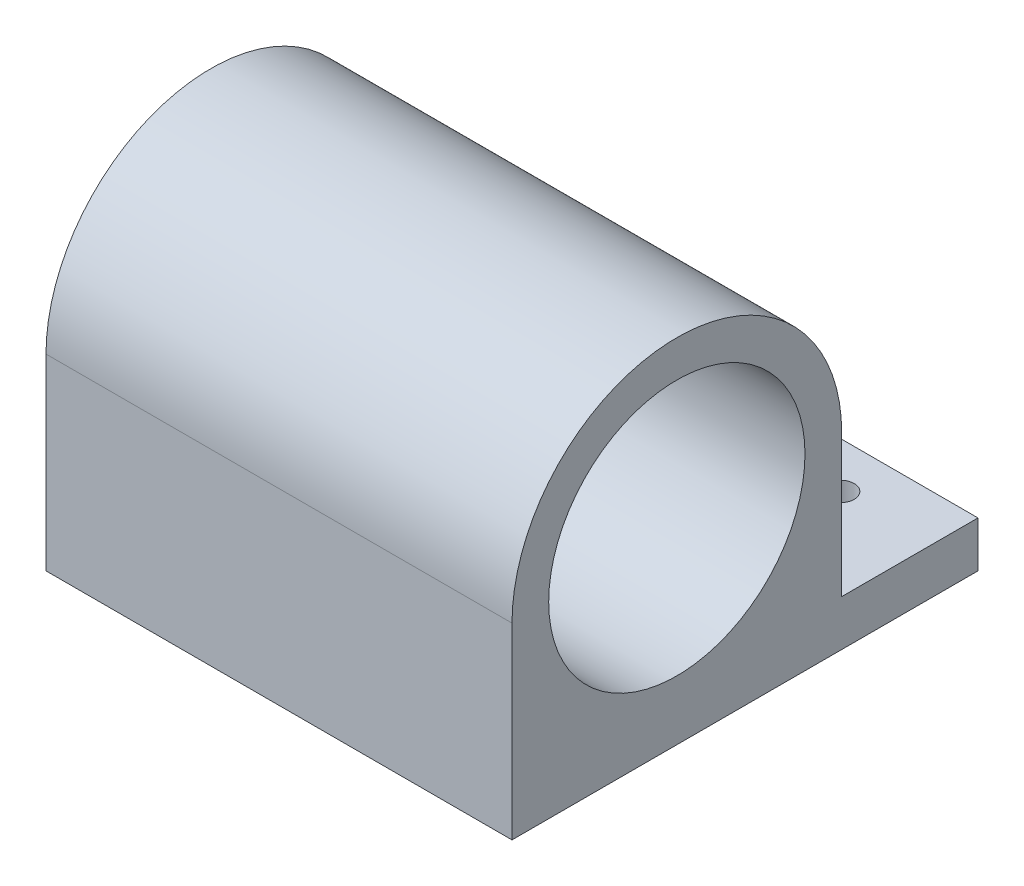
ISO-10303-21;
HEADER;
FILE_DESCRIPTION(('STEP AP214'),'2;1');
FILE_NAME('part.step','',(''),(''),'','','');
FILE_SCHEMA(('AUTOMOTIVE_DESIGN { 1 0 10303 214 1 1 1 1 }'));
ENDSEC;
DATA;
#1=APPLICATION_CONTEXT('core data for automotive mechanical design processes');
#2=APPLICATION_PROTOCOL_DEFINITION('international standard','automotive_design',2000,#1);
#3=PRODUCT_CONTEXT('',#1,'mechanical');
#4=PRODUCT('Part','Part','',(#3));
#5=PRODUCT_RELATED_PRODUCT_CATEGORY('part','',(#4));
#6=PRODUCT_DEFINITION_FORMATION('','',#4);
#7=PRODUCT_DEFINITION_CONTEXT('part definition',#1,'design');
#8=PRODUCT_DEFINITION('design','',#6,#7);
#9=PRODUCT_DEFINITION_SHAPE('','',#8);
#10=(LENGTH_UNIT() NAMED_UNIT(*) SI_UNIT(.MILLI.,.METRE.));
#11=(NAMED_UNIT(*) PLANE_ANGLE_UNIT() SI_UNIT($,.RADIAN.));
#12=(NAMED_UNIT(*) SI_UNIT($,.STERADIAN.) SOLID_ANGLE_UNIT());
#13=UNCERTAINTY_MEASURE_WITH_UNIT(LENGTH_MEASURE(1.E-05),#10,'distance_accuracy_value','');
#14=(GEOMETRIC_REPRESENTATION_CONTEXT(3) GLOBAL_UNCERTAINTY_ASSIGNED_CONTEXT((#13)) GLOBAL_UNIT_ASSIGNED_CONTEXT((#10,
#11,#12)) REPRESENTATION_CONTEXT('',''));
#15=CARTESIAN_POINT('',(0.,0.,0.));
#16=DIRECTION('',(0.,0.,1.));
#17=DIRECTION('',(1.,0.,0.));
#18=AXIS2_PLACEMENT_3D('',#15,#16,#17);
#19=CARTESIAN_POINT('',(0.,5.,0.));
#20=DIRECTION('',(0.,-1.,0.));
#21=DIRECTION('',(0.,0.,-1.));
#22=AXIS2_PLACEMENT_3D('',#19,#20,#21);
#23=PLANE('',#22);
#24=CARTESIAN_POINT('',(40.8,5.,-45.8));
#25=DIRECTION('',(0.,1.,0.));
#26=DIRECTION('',(0.,0.,1.));
#27=AXIS2_PLACEMENT_3D('',#24,#25,#26);
#28=CIRCLE('',#27,1.5);
#29=CARTESIAN_POINT('',(40.8,5.,-44.3));
#30=VERTEX_POINT('',#29);
#31=EDGE_CURVE('E159',#30,#30,#28,.T.);
#32=ORIENTED_EDGE('',*,*,#31,.F.);
#33=EDGE_LOOP('',(#32));
#34=FACE_BOUND('',#33,.T.);
#35=CARTESIAN_POINT('',(10.,5.,-45.8));
#36=DIRECTION('',(0.,1.,0.));
#37=DIRECTION('',(0.,0.,1.));
#38=AXIS2_PLACEMENT_3D('',#35,#36,#37);
#39=CIRCLE('',#38,1.5);
#40=CARTESIAN_POINT('',(10.,5.,-44.3));
#41=VERTEX_POINT('',#40);
#42=EDGE_CURVE('E98',#41,#41,#39,.T.);
#43=ORIENTED_EDGE('',*,*,#42,.F.);
#44=EDGE_LOOP('',(#43));
#45=FACE_BOUND('',#44,.T.);
#46=DIRECTION('',(-1.,0.,0.));
#47=VECTOR('',#46,1.);
#48=CARTESIAN_POINT('',(99.8909075084175,5.,-35.94));
#49=LINE('',#48,#47);
#50=CARTESIAN_POINT('',(50.8,5.,-35.94));
#51=VERTEX_POINT('',#50);
#52=CARTESIAN_POINT('',(0.,5.,-35.94));
#53=VERTEX_POINT('',#52);
#54=EDGE_CURVE('E50',#51,#53,#49,.T.);
#55=ORIENTED_EDGE('',*,*,#54,.F.);
#56=DIRECTION('',(0.,0.,-1.));
#57=VECTOR('',#56,1.);
#58=CARTESIAN_POINT('',(50.8,5.,0.));
#59=LINE('',#58,#57);
#60=CARTESIAN_POINT('',(50.8,5.,-50.8));
#61=VERTEX_POINT('',#60);
#62=EDGE_CURVE('E166',#51,#61,#59,.T.);
#63=ORIENTED_EDGE('',*,*,#62,.T.);
#64=DIRECTION('',(-1.,0.,0.));
#65=VECTOR('',#64,1.);
#66=CARTESIAN_POINT('',(0.,5.,-50.8));
#67=LINE('',#66,#65);
#68=CARTESIAN_POINT('',(0.,5.,-50.8));
#69=VERTEX_POINT('',#68);
#70=EDGE_CURVE('E56',#61,#69,#67,.T.);
#71=ORIENTED_EDGE('',*,*,#70,.T.);
#72=DIRECTION('',(0.,0.,1.));
#73=VECTOR('',#72,1.);
#74=CARTESIAN_POINT('',(0.,5.,0.));
#75=LINE('',#74,#73);
#76=EDGE_CURVE('E85',#69,#53,#75,.T.);
#77=ORIENTED_EDGE('',*,*,#76,.T.);
#78=EDGE_LOOP('',(#55,#63,#71,#77));
#79=FACE_BOUND('',#78,.T.);
#80=ADVANCED_FACE('F35',(#34,#45,#79),#23,.F.);
#81=CARTESIAN_POINT('',(0.,0.,0.));
#82=DIRECTION('',(0.,-1.,0.));
#83=DIRECTION('',(0.,0.,-1.));
#84=AXIS2_PLACEMENT_3D('',#81,#82,#83);
#85=PLANE('',#84);
#86=CARTESIAN_POINT('',(10.,0.,-45.8));
#87=DIRECTION('',(0.,1.,0.));
#88=DIRECTION('',(0.,0.,1.));
#89=AXIS2_PLACEMENT_3D('',#86,#87,#88);
#90=CIRCLE('',#89,1.5);
#91=CARTESIAN_POINT('',(10.,0.,-44.3));
#92=VERTEX_POINT('',#91);
#93=EDGE_CURVE('E102',#92,#92,#90,.T.);
#94=ORIENTED_EDGE('',*,*,#93,.T.);
#95=EDGE_LOOP('',(#94));
#96=FACE_BOUND('',#95,.T.);
#97=DIRECTION('',(0.,0.,1.));
#98=VECTOR('',#97,1.);
#99=CARTESIAN_POINT('',(0.,0.,0.));
#100=LINE('',#99,#98);
#101=CARTESIAN_POINT('',(0.,0.,-50.8));
#102=VERTEX_POINT('',#101);
#103=CARTESIAN_POINT('',(0.,0.,0.));
#104=VERTEX_POINT('',#103);
#105=EDGE_CURVE('E92',#102,#104,#100,.T.);
#106=ORIENTED_EDGE('',*,*,#105,.F.);
#107=DIRECTION('',(-1.,0.,0.));
#108=VECTOR('',#107,1.);
#109=CARTESIAN_POINT('',(0.,0.,-50.8));
#110=LINE('',#109,#108);
#111=CARTESIAN_POINT('',(50.8,0.,-50.8));
#112=VERTEX_POINT('',#111);
#113=EDGE_CURVE('E75',#112,#102,#110,.T.);
#114=ORIENTED_EDGE('',*,*,#113,.F.);
#115=DIRECTION('',(0.,0.,-1.));
#116=VECTOR('',#115,1.);
#117=CARTESIAN_POINT('',(50.8,0.,0.));
#118=LINE('',#117,#116);
#119=CARTESIAN_POINT('',(50.8,0.,0.));
#120=VERTEX_POINT('',#119);
#121=EDGE_CURVE('E86',#120,#112,#118,.T.);
#122=ORIENTED_EDGE('',*,*,#121,.F.);
#123=DIRECTION('',(1.,0.,0.));
#124=VECTOR('',#123,1.);
#125=CARTESIAN_POINT('',(0.,0.,0.));
#126=LINE('',#125,#124);
#127=EDGE_CURVE('E97',#104,#120,#126,.T.);
#128=ORIENTED_EDGE('',*,*,#127,.F.);
#129=EDGE_LOOP('',(#106,#114,#122,#128));
#130=FACE_BOUND('',#129,.T.);
#131=CARTESIAN_POINT('',(40.8,0.,-45.8));
#132=DIRECTION('',(0.,1.,0.));
#133=DIRECTION('',(0.,0.,1.));
#134=AXIS2_PLACEMENT_3D('',#131,#132,#133);
#135=CIRCLE('',#134,1.5);
#136=CARTESIAN_POINT('',(40.8,0.,-44.3));
#137=VERTEX_POINT('',#136);
#138=EDGE_CURVE('E157',#137,#137,#135,.T.);
#139=ORIENTED_EDGE('',*,*,#138,.T.);
#140=EDGE_LOOP('',(#139));
#141=FACE_BOUND('',#140,.T.);
#142=ADVANCED_FACE('F95',(#96,#130,#141),#85,.T.);
#143=CARTESIAN_POINT('',(0.,5.,0.));
#144=DIRECTION('',(1.,0.,0.));
#145=DIRECTION('',(0.,0.,-1.));
#146=AXIS2_PLACEMENT_3D('',#143,#144,#145);
#147=PLANE('',#146);
#148=ORIENTED_EDGE('',*,*,#105,.T.);
#149=DIRECTION('',(0.,-1.,0.));
#150=VECTOR('',#149,1.);
#151=CARTESIAN_POINT('',(0.,5.,0.));
#152=LINE('',#151,#150);
#153=CARTESIAN_POINT('',(0.,20.47,0.));
#154=VERTEX_POINT('',#153);
#155=EDGE_CURVE('E11',#154,#104,#152,.T.);
#156=ORIENTED_EDGE('',*,*,#155,.F.);
#157=CARTESIAN_POINT('',(0.,20.47,-17.97));
#158=DIRECTION('',(-1.,0.,0.));
#159=DIRECTION('',(0.,0.,1.));
#160=AXIS2_PLACEMENT_3D('',#157,#158,#159);
#161=CIRCLE('',#160,17.97);
#162=CARTESIAN_POINT('',(0.,20.47,-35.94));
#163=VERTEX_POINT('',#162);
#164=EDGE_CURVE('E138',#154,#163,#161,.T.);
#165=ORIENTED_EDGE('',*,*,#164,.T.);
#166=DIRECTION('',(0.,-1.,0.));
#167=VECTOR('',#166,1.);
#168=CARTESIAN_POINT('',(0.,0.,-35.94));
#169=LINE('',#168,#167);
#170=EDGE_CURVE('E143',#163,#53,#169,.T.);
#171=ORIENTED_EDGE('',*,*,#170,.T.);
#172=ORIENTED_EDGE('',*,*,#76,.F.);
#173=DIRECTION('',(0.,-1.,0.));
#174=VECTOR('',#173,1.);
#175=CARTESIAN_POINT('',(0.,5.,-50.8));
#176=LINE('',#175,#174);
#177=EDGE_CURVE('E78',#69,#102,#176,.T.);
#178=ORIENTED_EDGE('',*,*,#177,.T.);
#179=EDGE_LOOP('',(#148,#156,#165,#171,#172,#178));
#180=FACE_BOUND('',#179,.T.);
#181=CARTESIAN_POINT('',(0.,20.47,-17.97));
#182=DIRECTION('',(-1.,0.,0.));
#183=DIRECTION('',(0.,0.,1.));
#184=AXIS2_PLACEMENT_3D('',#181,#182,#183);
#185=CIRCLE('',#184,13.97);
#186=CARTESIAN_POINT('',(0.,20.47,-4.));
#187=VERTEX_POINT('',#186);
#188=EDGE_CURVE('E141',#187,#187,#185,.T.);
#189=ORIENTED_EDGE('',*,*,#188,.F.);
#190=EDGE_LOOP('',(#189));
#191=FACE_BOUND('',#190,.T.);
#192=ADVANCED_FACE('F37',(#180,#191),#147,.F.);
#193=CARTESIAN_POINT('',(0.,5.,0.));
#194=DIRECTION('',(0.,0.,-1.));
#195=DIRECTION('',(-1.,0.,0.));
#196=AXIS2_PLACEMENT_3D('',#193,#194,#195);
#197=PLANE('',#196);
#198=ORIENTED_EDGE('',*,*,#127,.T.);
#199=DIRECTION('',(0.,-1.,0.));
#200=VECTOR('',#199,1.);
#201=CARTESIAN_POINT('',(50.8,5.,0.));
#202=LINE('',#201,#200);
#203=CARTESIAN_POINT('',(50.8,20.47,0.));
#204=VERTEX_POINT('',#203);
#205=EDGE_CURVE('E43',#204,#120,#202,.T.);
#206=ORIENTED_EDGE('',*,*,#205,.F.);
#207=DIRECTION('',(-1.,0.,0.));
#208=VECTOR('',#207,1.);
#209=CARTESIAN_POINT('',(99.8909075084175,20.47,0.));
#210=LINE('',#209,#208);
#211=EDGE_CURVE('E122',#204,#154,#210,.T.);
#212=ORIENTED_EDGE('',*,*,#211,.T.);
#213=ORIENTED_EDGE('',*,*,#155,.T.);
#214=EDGE_LOOP('',(#198,#206,#212,#213));
#215=FACE_BOUND('',#214,.T.);
#216=ADVANCED_FACE('F120',(#215),#197,.F.);
#217=CARTESIAN_POINT('',(50.8,5.,0.));
#218=DIRECTION('',(-1.,0.,0.));
#219=DIRECTION('',(0.,0.,1.));
#220=AXIS2_PLACEMENT_3D('',#217,#218,#219);
#221=PLANE('',#220);
#222=ORIENTED_EDGE('',*,*,#121,.T.);
#223=DIRECTION('',(0.,-1.,0.));
#224=VECTOR('',#223,1.);
#225=CARTESIAN_POINT('',(50.8,5.,-50.8));
#226=LINE('',#225,#224);
#227=EDGE_CURVE('E81',#61,#112,#226,.T.);
#228=ORIENTED_EDGE('',*,*,#227,.F.);
#229=ORIENTED_EDGE('',*,*,#62,.F.);
#230=DIRECTION('',(0.,1.,0.));
#231=VECTOR('',#230,1.);
#232=CARTESIAN_POINT('',(50.8,0.,-35.94));
#233=LINE('',#232,#231);
#234=CARTESIAN_POINT('',(50.8,20.47,-35.94));
#235=VERTEX_POINT('',#234);
#236=EDGE_CURVE('E158',#51,#235,#233,.T.);
#237=ORIENTED_EDGE('',*,*,#236,.T.);
#238=CARTESIAN_POINT('',(50.8,20.47,-17.97));
#239=DIRECTION('',(-1.,0.,0.));
#240=DIRECTION('',(0.,0.,1.));
#241=AXIS2_PLACEMENT_3D('',#238,#239,#240);
#242=CIRCLE('',#241,17.97);
#243=EDGE_CURVE('E116',#235,#204,#242,.F.);
#244=ORIENTED_EDGE('',*,*,#243,.T.);
#245=ORIENTED_EDGE('',*,*,#205,.T.);
#246=EDGE_LOOP('',(#222,#228,#229,#237,#244,#245));
#247=FACE_BOUND('',#246,.T.);
#248=CARTESIAN_POINT('',(50.8,20.47,-17.97));
#249=DIRECTION('',(-1.,0.,0.));
#250=DIRECTION('',(0.,0.,1.));
#251=AXIS2_PLACEMENT_3D('',#248,#249,#250);
#252=CIRCLE('',#251,13.97);
#253=CARTESIAN_POINT('',(50.8,20.47,-4.));
#254=VERTEX_POINT('',#253);
#255=EDGE_CURVE('E154',#254,#254,#252,.F.);
#256=ORIENTED_EDGE('',*,*,#255,.F.);
#257=EDGE_LOOP('',(#256));
#258=FACE_BOUND('',#257,.T.);
#259=ADVANCED_FACE('F112',(#247,#258),#221,.F.);
#260=CARTESIAN_POINT('',(0.,5.,-50.8));
#261=DIRECTION('',(0.,0.,1.));
#262=DIRECTION('',(1.,0.,0.));
#263=AXIS2_PLACEMENT_3D('',#260,#261,#262);
#264=PLANE('',#263);
#265=ORIENTED_EDGE('',*,*,#113,.T.);
#266=ORIENTED_EDGE('',*,*,#177,.F.);
#267=ORIENTED_EDGE('',*,*,#70,.F.);
#268=ORIENTED_EDGE('',*,*,#227,.T.);
#269=EDGE_LOOP('',(#265,#266,#267,#268));
#270=FACE_BOUND('',#269,.T.);
#271=ADVANCED_FACE('F77',(#270),#264,.F.);
#272=CARTESIAN_POINT('',(10.,5.,-45.8));
#273=DIRECTION('',(0.,-1.,0.));
#274=DIRECTION('',(0.,0.,-1.));
#275=AXIS2_PLACEMENT_3D('',#272,#273,#274);
#276=CYLINDRICAL_SURFACE('',#275,1.5);
#277=ORIENTED_EDGE('',*,*,#42,.T.);
#278=EDGE_LOOP('',(#277));
#279=FACE_BOUND('',#278,.T.);
#280=ORIENTED_EDGE('',*,*,#93,.F.);
#281=EDGE_LOOP('',(#280));
#282=FACE_BOUND('',#281,.T.);
#283=ADVANCED_FACE('F178',(#279,#282),#276,.F.);
#284=CARTESIAN_POINT('',(40.8,5.,-45.8));
#285=DIRECTION('',(0.,-1.,0.));
#286=DIRECTION('',(0.,0.,-1.));
#287=AXIS2_PLACEMENT_3D('',#284,#285,#286);
#288=CYLINDRICAL_SURFACE('',#287,1.5);
#289=ORIENTED_EDGE('',*,*,#31,.T.);
#290=EDGE_LOOP('',(#289));
#291=FACE_BOUND('',#290,.T.);
#292=ORIENTED_EDGE('',*,*,#138,.F.);
#293=EDGE_LOOP('',(#292));
#294=FACE_BOUND('',#293,.T.);
#295=ADVANCED_FACE('F211',(#291,#294),#288,.F.);
#296=CARTESIAN_POINT('',(99.8909075084175,0.,-35.94));
#297=DIRECTION('',(0.,0.,-1.));
#298=DIRECTION('',(-1.,0.,0.));
#299=AXIS2_PLACEMENT_3D('',#296,#297,#298);
#300=PLANE('',#299);
#301=ORIENTED_EDGE('',*,*,#236,.F.);
#302=ORIENTED_EDGE('',*,*,#54,.T.);
#303=ORIENTED_EDGE('',*,*,#170,.F.);
#304=DIRECTION('',(-1.,0.,0.));
#305=VECTOR('',#304,1.);
#306=CARTESIAN_POINT('',(99.8909075084175,20.47,-35.94));
#307=LINE('',#306,#305);
#308=EDGE_CURVE('E134',#235,#163,#307,.T.);
#309=ORIENTED_EDGE('',*,*,#308,.F.);
#310=EDGE_LOOP('',(#301,#302,#303,#309));
#311=FACE_BOUND('',#310,.T.);
#312=ADVANCED_FACE('F144',(#311),#300,.T.);
#313=CARTESIAN_POINT('',(99.8909075084175,20.47,-17.97));
#314=DIRECTION('',(-1.,0.,0.));
#315=DIRECTION('',(0.,0.,1.));
#316=AXIS2_PLACEMENT_3D('',#313,#314,#315);
#317=CYLINDRICAL_SURFACE('',#316,17.97);
#318=ORIENTED_EDGE('',*,*,#243,.F.);
#319=ORIENTED_EDGE('',*,*,#308,.T.);
#320=ORIENTED_EDGE('',*,*,#164,.F.);
#321=ORIENTED_EDGE('',*,*,#211,.F.);
#322=EDGE_LOOP('',(#318,#319,#320,#321));
#323=FACE_BOUND('',#322,.T.);
#324=ADVANCED_FACE('F136',(#323),#317,.T.);
#325=CARTESIAN_POINT('',(99.8909075084175,20.47,-17.97));
#326=DIRECTION('',(-1.,0.,0.));
#327=DIRECTION('',(0.,0.,1.));
#328=AXIS2_PLACEMENT_3D('',#325,#326,#327);
#329=CYLINDRICAL_SURFACE('',#328,13.97);
#330=ORIENTED_EDGE('',*,*,#255,.T.);
#331=EDGE_LOOP('',(#330));
#332=FACE_BOUND('',#331,.T.);
#333=ORIENTED_EDGE('',*,*,#188,.T.);
#334=EDGE_LOOP('',(#333));
#335=FACE_BOUND('',#334,.T.);
#336=ADVANCED_FACE('F267',(#332,#335),#329,.F.);
#337=CLOSED_SHELL('',(#80,#142,#192,#216,#259,#271,#283,#295,#312,#324,#336));
#338=MANIFOLD_SOLID_BREP('B2',#337);
#339=ADVANCED_BREP_SHAPE_REPRESENTATION('',(#18,#338),#14);
#340=SHAPE_DEFINITION_REPRESENTATION(#9,#339);
ENDSEC;
END-ISO-10303-21;
